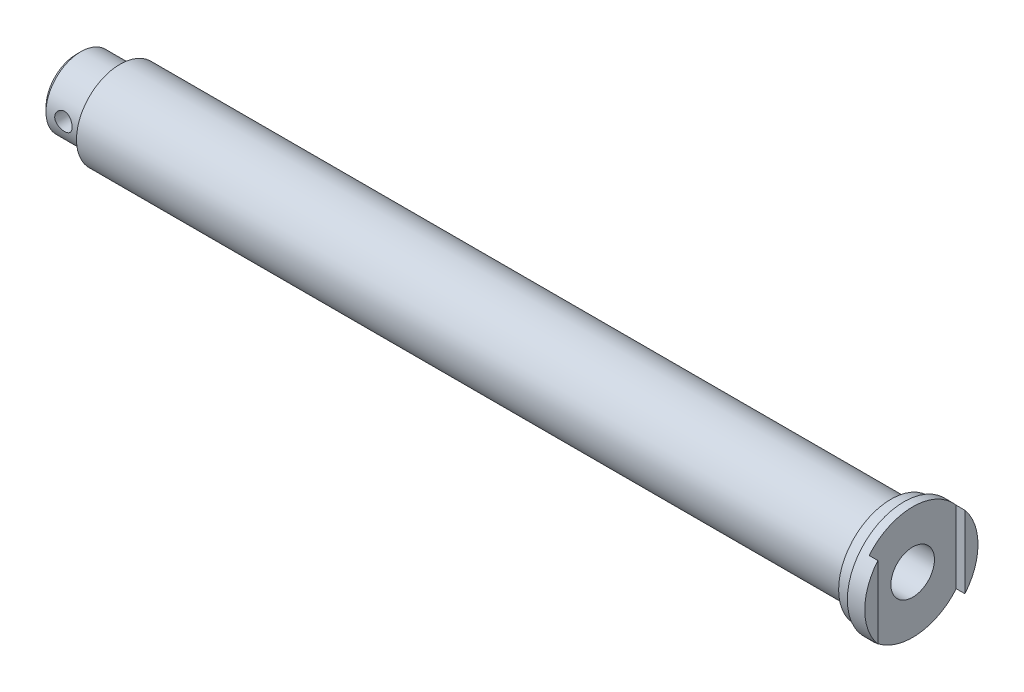
ISO-10303-21;
HEADER;
FILE_DESCRIPTION(('STEP AP214'),'2;1');
FILE_NAME('part.step','',(''),(''),'','','');
FILE_SCHEMA(('AUTOMOTIVE_DESIGN { 1 0 10303 214 1 1 1 1 }'));
ENDSEC;
DATA;
#1=APPLICATION_CONTEXT('core data for automotive mechanical design processes');
#2=APPLICATION_PROTOCOL_DEFINITION('international standard','automotive_design',2000,#1);
#3=PRODUCT_CONTEXT('',#1,'mechanical');
#4=PRODUCT('Part','Part','',(#3));
#5=PRODUCT_RELATED_PRODUCT_CATEGORY('part','',(#4));
#6=PRODUCT_DEFINITION_FORMATION('','',#4);
#7=PRODUCT_DEFINITION_CONTEXT('part definition',#1,'design');
#8=PRODUCT_DEFINITION('design','',#6,#7);
#9=PRODUCT_DEFINITION_SHAPE('','',#8);
#10=(LENGTH_UNIT() NAMED_UNIT(*) SI_UNIT(.MILLI.,.METRE.));
#11=(NAMED_UNIT(*) PLANE_ANGLE_UNIT() SI_UNIT($,.RADIAN.));
#12=(NAMED_UNIT(*) SI_UNIT($,.STERADIAN.) SOLID_ANGLE_UNIT());
#13=UNCERTAINTY_MEASURE_WITH_UNIT(LENGTH_MEASURE(1.E-05),#10,'distance_accuracy_value','');
#14=(GEOMETRIC_REPRESENTATION_CONTEXT(3) GLOBAL_UNCERTAINTY_ASSIGNED_CONTEXT((#13)) GLOBAL_UNIT_ASSIGNED_CONTEXT((#10,
#11,#12)) REPRESENTATION_CONTEXT('',''));
#15=CARTESIAN_POINT('',(0.,0.,0.));
#16=DIRECTION('',(0.,0.,1.));
#17=DIRECTION('',(1.,0.,0.));
#18=AXIS2_PLACEMENT_3D('',#15,#16,#17);
#19=CARTESIAN_POINT('',(0.,0.,0.));
#20=DIRECTION('',(-1.,0.,0.));
#21=DIRECTION('',(0.,0.,1.));
#22=AXIS2_PLACEMENT_3D('',#19,#20,#21);
#23=PLANE('',#22);
#24=CARTESIAN_POINT('',(0.,0.,0.));
#25=DIRECTION('',(-1.,0.,0.));
#26=DIRECTION('',(0.,0.,1.));
#27=AXIS2_PLACEMENT_3D('',#24,#25,#26);
#28=CIRCLE('',#27,6.5);
#29=CARTESIAN_POINT('',(0.,4.15331193145903,-5.));
#30=VERTEX_POINT('',#29);
#31=CARTESIAN_POINT('',(0.,-4.15331193145904,-5.));
#32=VERTEX_POINT('',#31);
#33=EDGE_CURVE('E110',#30,#32,#28,.T.);
#34=ORIENTED_EDGE('',*,*,#33,.F.);
#35=DIRECTION('',(0.,-1.,0.));
#36=VECTOR('',#35,1.);
#37=CARTESIAN_POINT('',(0.,0.,-5.));
#38=LINE('',#37,#36);
#39=EDGE_CURVE('E131',#30,#32,#38,.T.);
#40=ORIENTED_EDGE('',*,*,#39,.T.);
#41=EDGE_LOOP('',(#34,#40));
#42=FACE_BOUND('',#41,.T.);
#43=ADVANCED_FACE('F34',(#42),#23,.F.);
#44=CARTESIAN_POINT('',(-97.,0.,0.));
#45=DIRECTION('',(1.,0.,0.));
#46=DIRECTION('',(0.,0.,-1.));
#47=AXIS2_PLACEMENT_3D('',#44,#45,#46);
#48=PLANE('',#47);
#49=CARTESIAN_POINT('',(-97.,0.,0.));
#50=DIRECTION('',(1.,0.,0.));
#51=DIRECTION('',(0.,0.,-1.));
#52=AXIS2_PLACEMENT_3D('',#49,#50,#51);
#53=CIRCLE('',#52,3.5);
#54=CARTESIAN_POINT('',(-97.,0.,-3.5));
#55=VERTEX_POINT('',#54);
#56=EDGE_CURVE('E42',#55,#55,#53,.F.);
#57=ORIENTED_EDGE('',*,*,#56,.T.);
#58=EDGE_LOOP('',(#57));
#59=FACE_BOUND('',#58,.T.);
#60=ADVANCED_FACE('F198',(#59),#48,.F.);
#61=CARTESIAN_POINT('',(0.,0.,0.));
#62=DIRECTION('',(-1.,0.,0.));
#63=DIRECTION('',(0.,0.,1.));
#64=AXIS2_PLACEMENT_3D('',#61,#62,#63);
#65=CYLINDRICAL_SURFACE('',#64,4.);
#66=CARTESIAN_POINT('',(-96.5,0.,0.));
#67=DIRECTION('',(1.,0.,0.));
#68=DIRECTION('',(0.,0.,-1.));
#69=AXIS2_PLACEMENT_3D('',#66,#67,#68);
#70=CIRCLE('',#69,4.);
#71=CARTESIAN_POINT('',(-96.5,0.,-4.));
#72=VERTEX_POINT('',#71);
#73=EDGE_CURVE('E11',#72,#72,#70,.T.);
#74=ORIENTED_EDGE('',*,*,#73,.T.);
#75=EDGE_LOOP('',(#74));
#76=FACE_BOUND('',#75,.T.);
#77=CARTESIAN_POINT('',(-93.5,0.,4.));
#78=CARTESIAN_POINT('',(-93.5000015504921,-0.0552507257798213,3.99999906578675));
#79=CARTESIAN_POINT('',(-93.5045943671825,-0.110518771887177,3.99884385421219));
#80=CARTESIAN_POINT('',(-93.522816767538,-0.219470882513689,3.99434742553261));
#81=CARTESIAN_POINT('',(-93.5364514730252,-0.273154031247159,3.99100496946646));
#82=CARTESIAN_POINT('',(-93.5722928356414,-0.377347248121718,3.98250417554693));
#83=CARTESIAN_POINT('',(-93.5944891991435,-0.427861042286671,3.97734801894725));
#84=CARTESIAN_POINT('',(-93.6467875933632,-0.524448087936287,3.96576895871729));
#85=CARTESIAN_POINT('',(-93.676889890746,-0.570521189565841,3.95934601236034));
#86=CARTESIAN_POINT('',(-93.7448005264361,-0.657867951533947,3.94578275727868));
#87=CARTESIAN_POINT('',(-93.7827410499728,-0.69903712670738,3.93863138099022));
#88=CARTESIAN_POINT('',(-93.8649681366059,-0.774499284802202,3.92449080078353));
#89=CARTESIAN_POINT('',(-93.9092554152977,-0.808791491299422,3.91750161525566));
#90=CARTESIAN_POINT('',(-94.0037301511583,-0.870017695199357,3.9043651713314));
#91=CARTESIAN_POINT('',(-94.0539954872069,-0.896834810616908,3.89823196313737));
#92=CARTESIAN_POINT('',(-94.1584989411056,-0.941597939033691,3.88766329874815));
#93=CARTESIAN_POINT('',(-94.2127364222172,-0.959545370292895,3.88322757115192));
#94=CARTESIAN_POINT('',(-94.3224956654683,-0.985703224536202,3.87666984478367));
#95=CARTESIAN_POINT('',(-94.3779699306999,-0.994101512222236,3.87450327383617));
#96=CARTESIAN_POINT('',(-94.4895790460093,-1.00150785004524,3.8725957502516));
#97=CARTESIAN_POINT('',(-94.5457137871324,-1.00051742787866,3.87285440299096));
#98=CARTESIAN_POINT('',(-94.6556105384963,-0.989324349759533,3.87572803664412));
#99=CARTESIAN_POINT('',(-94.7093970809767,-0.979345560127028,3.87828575334586));
#100=CARTESIAN_POINT('',(-94.8145073672742,-0.950816124602089,3.88537806450989));
#101=CARTESIAN_POINT('',(-94.8658309353526,-0.932264868046299,3.88991279980464));
#102=CARTESIAN_POINT('',(-94.9651586775013,-0.88692631862479,3.90050075936124));
#103=CARTESIAN_POINT('',(-95.0131241145263,-0.860057778155299,3.90656884979614));
#104=CARTESIAN_POINT('',(-95.1039458065045,-0.798904184009995,3.91953140564257));
#105=CARTESIAN_POINT('',(-95.1468011653782,-0.764617832539249,3.9264260155649));
#106=CARTESIAN_POINT('',(-95.2274690771296,-0.688442283120835,3.9405058702652));
#107=CARTESIAN_POINT('',(-95.2651029933742,-0.646364172110598,3.94769379651981));
#108=CARTESIAN_POINT('',(-95.3328141616426,-0.556407945002494,3.96137310385857));
#109=CARTESIAN_POINT('',(-95.3628911828424,-0.508529651805324,3.96786446366277));
#110=CARTESIAN_POINT('',(-95.4147003908163,-0.408077259120955,3.97945154729455));
#111=CARTESIAN_POINT('',(-95.4364035601696,-0.355487595472441,3.9845424008515));
#112=CARTESIAN_POINT('',(-95.4706115371397,-0.247250672095278,3.99271944660945));
#113=CARTESIAN_POINT('',(-95.4831181042788,-0.191603999433677,3.99580602226187));
#114=CARTESIAN_POINT('',(-95.4983050437059,-0.0803599802600387,3.9995699951425));
#115=CARTESIAN_POINT('',(-95.5012286840502,-0.0247978133254956,4.00030702338852));
#116=CARTESIAN_POINT('',(-95.4978339986297,0.0860219165343142,3.999458698763));
#117=CARTESIAN_POINT('',(-95.4915165048006,0.141279506429705,3.99787355494564));
#118=CARTESIAN_POINT('',(-95.4700193944058,0.2490761791843,3.99259720751572));
#119=CARTESIAN_POINT('',(-95.4549724910153,0.301643412645807,3.98893756123874));
#120=CARTESIAN_POINT('',(-95.4165952773144,0.403504861634978,3.97992471089423));
#121=CARTESIAN_POINT('',(-95.3932641304579,0.452798746021728,3.97457133579928));
#122=CARTESIAN_POINT('',(-95.3385092474169,0.547682089619874,3.96262205284207));
#123=CARTESIAN_POINT('',(-95.3069492584022,0.593190294557198,3.95600578244622));
#124=CARTESIAN_POINT('',(-95.2368067274687,0.678351075762143,3.94229672791613));
#125=CARTESIAN_POINT('',(-95.1982229735887,0.718002639315318,3.93520386167804));
#126=CARTESIAN_POINT('',(-95.1139986927704,0.791327045381799,3.92112637973848));
#127=CARTESIAN_POINT('',(-95.0682081979984,0.824829245081332,3.91414869458188));
#128=CARTESIAN_POINT('',(-94.9715115770229,0.883673839341777,3.90128585584826));
#129=CARTESIAN_POINT('',(-94.9206056780268,0.909016596105273,3.89540065378018));
#130=CARTESIAN_POINT('',(-94.815396185058,0.950634280406178,3.88545396489777));
#131=CARTESIAN_POINT('',(-94.7611149144373,0.966962931102692,3.88138170194604));
#132=CARTESIAN_POINT('',(-94.6504602414073,0.990230439969168,3.87551162726789));
#133=CARTESIAN_POINT('',(-94.5940872993117,0.997171351652423,3.87371331813291));
#134=CARTESIAN_POINT('',(-94.4825859840965,1.00135906022265,3.87263267469305));
#135=CARTESIAN_POINT('',(-94.4274683765835,0.998878598520066,3.87327955152176));
#136=CARTESIAN_POINT('',(-94.3184640742214,0.984918185541902,3.87685272671895));
#137=CARTESIAN_POINT('',(-94.2645773546576,0.973438415124506,3.87977897927905));
#138=CARTESIAN_POINT('',(-94.1598610272898,0.941954212961856,3.88754173788482));
#139=CARTESIAN_POINT('',(-94.1090151298399,0.922000936453573,3.89236676824207));
#140=CARTESIAN_POINT('',(-94.0113564115242,0.874176609070035,3.90338503816553));
#141=CARTESIAN_POINT('',(-93.9645441512087,0.846304460022783,3.90957846747182));
#142=CARTESIAN_POINT('',(-93.8749635806653,0.782578499091416,3.92283756175675));
#143=CARTESIAN_POINT('',(-93.8323326177174,0.746535441941495,3.92992176554505));
#144=CARTESIAN_POINT('',(-93.7536353034697,0.66785958079315,3.94405351497524));
#145=CARTESIAN_POINT('',(-93.717570513258,0.625225214174091,3.95110105151373));
#146=CARTESIAN_POINT('',(-93.6523924609569,0.533645057801726,3.96451770431775));
#147=CARTESIAN_POINT('',(-93.623416924219,0.484598948210929,3.97087222243912));
#148=CARTESIAN_POINT('',(-93.5741683580397,0.382177373006994,3.98203283316746));
#149=CARTESIAN_POINT('',(-93.553889092901,0.328805042291168,3.98684003466521));
#150=CARTESIAN_POINT('',(-93.5256187797802,0.229606835495654,3.99365373043694));
#151=CARTESIAN_POINT('',(-93.516032504631,0.184253447272052,3.9960172336846));
#152=CARTESIAN_POINT('',(-93.5032227042521,0.0926040476908594,3.99919070154632));
#153=CARTESIAN_POINT('',(-93.4999987004632,0.0463081074950795,4.00000078300596));
#154=CARTESIAN_POINT('',(-93.5,0.,4.));
#155=B_SPLINE_CURVE_WITH_KNOTS('',3,(#77,#78,#79,#80,#81,#82,#83,#84,#85,#86,#87,#88,#89,#90,
#91,#92,#93,#94,#95,#96,#97,#98,#99,#100,#101,#102,#103,#104,#105,#106,#107,#108,#109,#110,#111,
#112,#113,#114,#115,#116,#117,#118,#119,#120,#121,#122,#123,#124,#125,#126,#127,#128,#129,#130,
#131,#132,#133,#134,#135,#136,#137,#138,#139,#140,#141,#142,#143,#144,#145,#146,#147,#148,#149,
#150,#151,#152,#153,#154),.UNSPECIFIED.,.T.,.F.,(4,2,2,2,2,2,2,2,2,2,2,2,2,2,2,2,2,2,2,2,2,2,2,
2,2,2,2,2,2,2,2,2,2,2,2,2,2,2,4),(0.,0.16558247498126,0.331258825175928,0.496736601524072,
0.662219960112881,0.830762902914253,0.999324863867069,1.17039098363871,1.34142974112913,
1.50904196732955,1.67662692075131,1.84014998004676,2.00368468977357,2.16887018582585,
2.3340846055744,2.50401000646012,2.67394059705497,2.84445486006075,3.01493649125762,
3.18105539299517,3.34715934075161,3.51080183009357,3.67446084881526,3.84102391710234,
4.00761575338678,4.17829672802983,4.34897012499671,4.51861503076023,4.6882228216827,
4.85295853599073,5.01769093970688,5.18144267039631,5.34521712091267,5.51326384273273,
5.68135046513611,5.85248123666389,6.02348909214231,6.16228161961431,6.30106370695358),.UNSPECIFIED.);
#156=CARTESIAN_POINT('',(-93.5,0.,4.));
#157=VERTEX_POINT('',#156);
#158=EDGE_CURVE('E94',#157,#157,#155,.T.);
#159=ORIENTED_EDGE('',*,*,#158,.T.);
#160=EDGE_LOOP('',(#159));
#161=FACE_BOUND('',#160,.T.);
#162=CARTESIAN_POINT('',(-93.5,0.,-4.));
#163=CARTESIAN_POINT('',(-93.5000015504921,0.0552507257798096,-3.99999906578675));
#164=CARTESIAN_POINT('',(-93.5045943671825,0.110518771887165,-3.99884385421219));
#165=CARTESIAN_POINT('',(-93.522816767538,0.219470882513678,-3.99434742553261));
#166=CARTESIAN_POINT('',(-93.5364514730252,0.273154031247147,-3.99100496946646));
#167=CARTESIAN_POINT('',(-93.5722928356414,0.377347248121707,-3.98250417554693));
#168=CARTESIAN_POINT('',(-93.5944891991435,0.42786104228666,-3.97734801894725));
#169=CARTESIAN_POINT('',(-93.6467875933632,0.524448087936274,-3.96576895871729));
#170=CARTESIAN_POINT('',(-93.676889890746,0.570521189565826,-3.95934601236034));
#171=CARTESIAN_POINT('',(-93.7448005264362,0.657867951533932,-3.94578275727868));
#172=CARTESIAN_POINT('',(-93.7827410499728,0.699037126707368,-3.93863138099022));
#173=CARTESIAN_POINT('',(-93.8649681366059,0.774499284802191,-3.92449080078353));
#174=CARTESIAN_POINT('',(-93.9092554152977,0.808791491299412,-3.91750161525566));
#175=CARTESIAN_POINT('',(-94.0037301511583,0.870017695199346,-3.9043651713314));
#176=CARTESIAN_POINT('',(-94.0539954872069,0.896834810616896,-3.89823196313737));
#177=CARTESIAN_POINT('',(-94.1584989411056,0.941597939033675,-3.88766329874816));
#178=CARTESIAN_POINT('',(-94.2127364222172,0.959545370292877,-3.88322757115193));
#179=CARTESIAN_POINT('',(-94.3224956654683,0.98570322453618,-3.87666984478368));
#180=CARTESIAN_POINT('',(-94.3779699306999,0.994101512222213,-3.87450327383618));
#181=CARTESIAN_POINT('',(-94.4895790460093,1.00150785004522,-3.87259575025161));
#182=CARTESIAN_POINT('',(-94.5457137871324,1.00051742787864,-3.87285440299096));
#183=CARTESIAN_POINT('',(-94.6556105384963,0.989324349759507,-3.87572803664412));
#184=CARTESIAN_POINT('',(-94.7093970809767,0.979345560127,-3.87828575334587));
#185=CARTESIAN_POINT('',(-94.8145073672742,0.950816124602056,-3.88537806450989));
#186=CARTESIAN_POINT('',(-94.8658309353526,0.932264868046266,-3.88991279980465));
#187=CARTESIAN_POINT('',(-94.9651586775014,0.886926318624754,-3.90050075936125));
#188=CARTESIAN_POINT('',(-95.0131241145264,0.860057778155262,-3.90656884979614));
#189=CARTESIAN_POINT('',(-95.1039458065046,0.79890418400996,-3.91953140564257));
#190=CARTESIAN_POINT('',(-95.1468011653782,0.764617832539215,-3.9264260155649));
#191=CARTESIAN_POINT('',(-95.2274690771296,0.688442283120799,-3.94050587026521));
#192=CARTESIAN_POINT('',(-95.2651029933742,0.646364172110561,-3.94769379651981));
#193=CARTESIAN_POINT('',(-95.3328141616426,0.556407945002454,-3.96137310385857));
#194=CARTESIAN_POINT('',(-95.3628911828424,0.508529651805281,-3.96786446366277));
#195=CARTESIAN_POINT('',(-95.4147003908163,0.408077259120908,-3.97945154729455));
#196=CARTESIAN_POINT('',(-95.4364035601696,0.355487595472392,-3.9845424008515));
#197=CARTESIAN_POINT('',(-95.4706115371397,0.24725067209523,-3.99271944660946));
#198=CARTESIAN_POINT('',(-95.4831181042788,0.191603999433634,-3.99580602226187));
#199=CARTESIAN_POINT('',(-95.4983050437059,0.0803599802599993,-3.9995699951425));
#200=CARTESIAN_POINT('',(-95.5012286840502,0.024797813325455,-4.00030702338852));
#201=CARTESIAN_POINT('',(-95.4978339986297,-0.0860219165343546,-3.999458698763));
#202=CARTESIAN_POINT('',(-95.4915165048006,-0.141279506429744,-3.99787355494564));
#203=CARTESIAN_POINT('',(-95.4700193944057,-0.249076179184343,-3.99259720751571));
#204=CARTESIAN_POINT('',(-95.4549724910153,-0.301643412645854,-3.98893756123874));
#205=CARTESIAN_POINT('',(-95.4165952773144,-0.403504861635024,-3.97992471089422));
#206=CARTESIAN_POINT('',(-95.3932641304579,-0.45279874602177,-3.97457133579928));
#207=CARTESIAN_POINT('',(-95.3385092474168,-0.547682089619911,-3.96262205284207));
#208=CARTESIAN_POINT('',(-95.3069492584021,-0.593190294557236,-3.95600578244621));
#209=CARTESIAN_POINT('',(-95.2368067274687,-0.678351075762181,-3.94229672791613));
#210=CARTESIAN_POINT('',(-95.1982229735887,-0.718002639315353,-3.93520386167803));
#211=CARTESIAN_POINT('',(-95.1139986927704,-0.791327045381834,-3.92112637973847));
#212=CARTESIAN_POINT('',(-95.0682081979984,-0.82482924508137,-3.91414869458187));
#213=CARTESIAN_POINT('',(-94.9715115770229,-0.883673839341813,-3.90128585584825));
#214=CARTESIAN_POINT('',(-94.9206056780268,-0.909016596105304,-3.89540065378017));
#215=CARTESIAN_POINT('',(-94.8153961850579,-0.950634280406206,-3.88545396489776));
#216=CARTESIAN_POINT('',(-94.7611149144373,-0.966962931102721,-3.88138170194603));
#217=CARTESIAN_POINT('',(-94.6504602414072,-0.990230439969196,-3.87551162726789));
#218=CARTESIAN_POINT('',(-94.5940872993117,-0.997171351652449,-3.8737133181329));
#219=CARTESIAN_POINT('',(-94.4825859840965,-1.00135906022267,-3.87263267469304));
#220=CARTESIAN_POINT('',(-94.4274683765835,-0.998878598520088,-3.87327955152175));
#221=CARTESIAN_POINT('',(-94.3184640742213,-0.98491818554192,-3.87685272671895));
#222=CARTESIAN_POINT('',(-94.2645773546576,-0.973438415124521,-3.87977897927904));
#223=CARTESIAN_POINT('',(-94.1598610272897,-0.941954212961872,-3.88754173788481));
#224=CARTESIAN_POINT('',(-94.1090151298398,-0.922000936453593,-3.89236676824206));
#225=CARTESIAN_POINT('',(-94.0113564115242,-0.874176609070056,-3.90338503816552));
#226=CARTESIAN_POINT('',(-93.9645441512087,-0.846304460022799,-3.90957846747182));
#227=CARTESIAN_POINT('',(-93.8749635806653,-0.782578499091428,-3.92283756175675));
#228=CARTESIAN_POINT('',(-93.8323326177174,-0.746535441941506,-3.92992176554505));
#229=CARTESIAN_POINT('',(-93.7536353034697,-0.667859580793158,-3.94405351497524));
#230=CARTESIAN_POINT('',(-93.717570513258,-0.625225214174097,-3.95110105151373));
#231=CARTESIAN_POINT('',(-93.6523924609569,-0.533645057801732,-3.96451770431775));
#232=CARTESIAN_POINT('',(-93.6234169242189,-0.484598948210937,-3.97087222243912));
#233=CARTESIAN_POINT('',(-93.5741683580396,-0.382177373007001,-3.98203283316745));
#234=CARTESIAN_POINT('',(-93.553889092901,-0.328805042291174,-3.98684003466521));
#235=CARTESIAN_POINT('',(-93.5256187797802,-0.229606835495659,-3.99365373043694));
#236=CARTESIAN_POINT('',(-93.5160325046311,-0.184253447272057,-3.9960172336846));
#237=CARTESIAN_POINT('',(-93.503222704252,-0.0926040476908672,-3.99919070154632));
#238=CARTESIAN_POINT('',(-93.4999987004631,-0.0463081074950894,-4.00000078300596));
#239=CARTESIAN_POINT('',(-93.5,0.,-4.));
#240=B_SPLINE_CURVE_WITH_KNOTS('',3,(#162,#163,#164,#165,#166,#167,#168,#169,#170,#171,#172,
#173,#174,#175,#176,#177,#178,#179,#180,#181,#182,#183,#184,#185,#186,#187,#188,#189,#190,#191,
#192,#193,#194,#195,#196,#197,#198,#199,#200,#201,#202,#203,#204,#205,#206,#207,#208,#209,#210,
#211,#212,#213,#214,#215,#216,#217,#218,#219,#220,#221,#222,#223,#224,#225,#226,#227,#228,#229,
#230,#231,#232,#233,#234,#235,#236,#237,#238,#239),.UNSPECIFIED.,.T.,.F.,(4,2,2,2,2,2,2,2,2,2,2,
2,2,2,2,2,2,2,2,2,2,2,2,2,2,2,2,2,2,2,2,2,2,2,2,2,2,2,4),(0.,0.165582474981262,
0.331258825175934,0.496736601524079,0.662219960112883,0.830762902914258,0.999324863867074,
1.17039098363873,1.34142974112913,1.50904196732954,1.67662692075131,1.84014998004678,
2.00368468977359,2.16887018582585,2.33408460557441,2.50401000646011,2.67394059705498,
2.84445486006076,3.01493649125762,3.18105539299517,3.34715934075161,3.51080183009358,
3.67446084881526,3.84102391710234,4.00761575338679,4.17829672802983,4.34897012499671,
4.51861503076024,4.68822282168271,4.85295853599074,5.01769093970689,5.1814426703963,
5.34521712091267,5.51326384273273,5.68135046513612,5.8524812366639,6.02348909214232,
6.16228161961431,6.30106370695358),.UNSPECIFIED.);
#241=CARTESIAN_POINT('',(-93.5,0.,-4.));
#242=VERTEX_POINT('',#241);
#243=EDGE_CURVE('E138',#242,#242,#240,.T.);
#244=ORIENTED_EDGE('',*,*,#243,.T.);
#245=EDGE_LOOP('',(#244));
#246=FACE_BOUND('',#245,.T.);
#247=CARTESIAN_POINT('',(-92.,0.,0.));
#248=DIRECTION('',(-1.,0.,0.));
#249=DIRECTION('',(0.,0.,1.));
#250=AXIS2_PLACEMENT_3D('',#247,#248,#249);
#251=CIRCLE('',#250,4.);
#252=CARTESIAN_POINT('',(-92.,0.,4.));
#253=VERTEX_POINT('',#252);
#254=EDGE_CURVE('E126',#253,#253,#251,.T.);
#255=ORIENTED_EDGE('',*,*,#254,.T.);
#256=EDGE_LOOP('',(#255));
#257=FACE_BOUND('',#256,.T.);
#258=ADVANCED_FACE('F149',(#76,#161,#246,#257),#65,.T.);
#259=CARTESIAN_POINT('',(-92.,5.,0.));
#260=DIRECTION('',(1.,0.,0.));
#261=DIRECTION('',(0.,0.,-1.));
#262=AXIS2_PLACEMENT_3D('',#259,#260,#261);
#263=PLANE('',#262);
#264=ORIENTED_EDGE('',*,*,#254,.F.);
#265=EDGE_LOOP('',(#264));
#266=FACE_BOUND('',#265,.T.);
#267=CARTESIAN_POINT('',(-92.,0.,0.));
#268=DIRECTION('',(-1.,0.,0.));
#269=DIRECTION('',(0.,0.,1.));
#270=AXIS2_PLACEMENT_3D('',#267,#268,#269);
#271=CIRCLE('',#270,5.);
#272=CARTESIAN_POINT('',(-92.,0.,5.));
#273=VERTEX_POINT('',#272);
#274=EDGE_CURVE('E123',#273,#273,#271,.T.);
#275=ORIENTED_EDGE('',*,*,#274,.T.);
#276=EDGE_LOOP('',(#275));
#277=FACE_BOUND('',#276,.T.);
#278=ADVANCED_FACE('F191',(#266,#277),#263,.F.);
#279=CARTESIAN_POINT('',(0.,0.,0.));
#280=DIRECTION('',(-1.,0.,0.));
#281=DIRECTION('',(0.,0.,1.));
#282=AXIS2_PLACEMENT_3D('',#279,#280,#281);
#283=CYLINDRICAL_SURFACE('',#282,5.);
#284=ORIENTED_EDGE('',*,*,#274,.F.);
#285=EDGE_LOOP('',(#284));
#286=FACE_BOUND('',#285,.T.);
#287=CARTESIAN_POINT('',(-3.5,0.,0.));
#288=DIRECTION('',(-1.,0.,0.));
#289=DIRECTION('',(0.,0.,1.));
#290=AXIS2_PLACEMENT_3D('',#287,#288,#289);
#291=CIRCLE('',#290,5.);
#292=CARTESIAN_POINT('',(-3.5,0.,5.));
#293=VERTEX_POINT('',#292);
#294=EDGE_CURVE('E120',#293,#293,#291,.T.);
#295=ORIENTED_EDGE('',*,*,#294,.T.);
#296=EDGE_LOOP('',(#295));
#297=FACE_BOUND('',#296,.T.);
#298=ADVANCED_FACE('F188',(#286,#297),#283,.T.);
#299=CARTESIAN_POINT('',(-3.5,5.,0.));
#300=DIRECTION('',(1.,0.,0.));
#301=DIRECTION('',(0.,0.,-1.));
#302=AXIS2_PLACEMENT_3D('',#299,#300,#301);
#303=PLANE('',#302);
#304=ORIENTED_EDGE('',*,*,#294,.F.);
#305=EDGE_LOOP('',(#304));
#306=FACE_BOUND('',#305,.T.);
#307=CARTESIAN_POINT('',(-3.5,0.,0.));
#308=DIRECTION('',(-1.,0.,0.));
#309=DIRECTION('',(0.,0.,1.));
#310=AXIS2_PLACEMENT_3D('',#307,#308,#309);
#311=CIRCLE('',#310,6.);
#312=CARTESIAN_POINT('',(-3.5,0.,6.));
#313=VERTEX_POINT('',#312);
#314=EDGE_CURVE('E117',#313,#313,#311,.T.);
#315=ORIENTED_EDGE('',*,*,#314,.T.);
#316=EDGE_LOOP('',(#315));
#317=FACE_BOUND('',#316,.T.);
#318=ADVANCED_FACE('F184',(#306,#317),#303,.F.);
#319=CARTESIAN_POINT('',(0.,0.,0.));
#320=DIRECTION('',(-1.,0.,0.));
#321=DIRECTION('',(0.,0.,1.));
#322=AXIS2_PLACEMENT_3D('',#319,#320,#321);
#323=CYLINDRICAL_SURFACE('',#322,6.);
#324=ORIENTED_EDGE('',*,*,#314,.F.);
#325=EDGE_LOOP('',(#324));
#326=FACE_BOUND('',#325,.T.);
#327=CARTESIAN_POINT('',(-2.,0.,0.));
#328=DIRECTION('',(-1.,0.,0.));
#329=DIRECTION('',(0.,0.,1.));
#330=AXIS2_PLACEMENT_3D('',#327,#328,#329);
#331=CIRCLE('',#330,6.);
#332=CARTESIAN_POINT('',(-2.,0.,6.));
#333=VERTEX_POINT('',#332);
#334=EDGE_CURVE('E114',#333,#333,#331,.T.);
#335=ORIENTED_EDGE('',*,*,#334,.T.);
#336=EDGE_LOOP('',(#335));
#337=FACE_BOUND('',#336,.T.);
#338=ADVANCED_FACE('F180',(#326,#337),#323,.T.);
#339=CARTESIAN_POINT('',(-2.,6.,0.));
#340=DIRECTION('',(1.,0.,0.));
#341=DIRECTION('',(0.,0.,-1.));
#342=AXIS2_PLACEMENT_3D('',#339,#340,#341);
#343=PLANE('',#342);
#344=ORIENTED_EDGE('',*,*,#334,.F.);
#345=EDGE_LOOP('',(#344));
#346=FACE_BOUND('',#345,.T.);
#347=CARTESIAN_POINT('',(-2.,0.,0.));
#348=DIRECTION('',(-1.,0.,0.));
#349=DIRECTION('',(0.,0.,1.));
#350=AXIS2_PLACEMENT_3D('',#347,#348,#349);
#351=CIRCLE('',#350,6.5);
#352=CARTESIAN_POINT('',(-2.,0.,6.5));
#353=VERTEX_POINT('',#352);
#354=EDGE_CURVE('E111',#353,#353,#351,.T.);
#355=ORIENTED_EDGE('',*,*,#354,.T.);
#356=EDGE_LOOP('',(#355));
#357=FACE_BOUND('',#356,.T.);
#358=ADVANCED_FACE('F176',(#346,#357),#343,.F.);
#359=CARTESIAN_POINT('',(0.,0.,0.));
#360=DIRECTION('',(-1.,0.,0.));
#361=DIRECTION('',(0.,0.,1.));
#362=AXIS2_PLACEMENT_3D('',#359,#360,#361);
#363=CYLINDRICAL_SURFACE('',#362,6.5);
#364=CARTESIAN_POINT('',(-1.,0.,0.));
#365=DIRECTION('',(-1.,0.,0.));
#366=DIRECTION('',(0.,0.,1.));
#367=AXIS2_PLACEMENT_3D('',#364,#365,#366);
#368=CIRCLE('',#367,6.5);
#369=CARTESIAN_POINT('',(-1.,4.15331193145904,5.));
#370=VERTEX_POINT('',#369);
#371=CARTESIAN_POINT('',(-1.,4.15331193145904,-5.));
#372=VERTEX_POINT('',#371);
#373=EDGE_CURVE('E137',#370,#372,#368,.T.);
#374=ORIENTED_EDGE('',*,*,#373,.T.);
#375=DIRECTION('',(-1.,0.,0.));
#376=VECTOR('',#375,1.);
#377=CARTESIAN_POINT('',(0.,4.15331193145904,-5.));
#378=LINE('',#377,#376);
#379=EDGE_CURVE('E57',#372,#30,#378,.F.);
#380=ORIENTED_EDGE('',*,*,#379,.T.);
#381=ORIENTED_EDGE('',*,*,#33,.T.);
#382=DIRECTION('',(-1.,0.,0.));
#383=VECTOR('',#382,1.);
#384=CARTESIAN_POINT('',(0.,-4.15331193145904,-5.));
#385=LINE('',#384,#383);
#386=CARTESIAN_POINT('',(-1.,-4.15331193145904,-5.));
#387=VERTEX_POINT('',#386);
#388=EDGE_CURVE('E104',#32,#387,#385,.T.);
#389=ORIENTED_EDGE('',*,*,#388,.T.);
#390=CARTESIAN_POINT('',(-1.,-4.15331193145904,5.));
#391=VERTEX_POINT('',#390);
#392=EDGE_CURVE('E134',#387,#391,#368,.T.);
#393=ORIENTED_EDGE('',*,*,#392,.T.);
#394=DIRECTION('',(-1.,0.,0.));
#395=VECTOR('',#394,1.);
#396=CARTESIAN_POINT('',(0.,-4.15331193145904,5.));
#397=LINE('',#396,#395);
#398=CARTESIAN_POINT('',(0.,-4.15331193145904,5.));
#399=VERTEX_POINT('',#398);
#400=EDGE_CURVE('E99',#391,#399,#397,.F.);
#401=ORIENTED_EDGE('',*,*,#400,.T.);
#402=CARTESIAN_POINT('',(0.,4.15331193145904,5.));
#403=VERTEX_POINT('',#402);
#404=EDGE_CURVE('E107',#399,#403,#28,.T.);
#405=ORIENTED_EDGE('',*,*,#404,.T.);
#406=DIRECTION('',(-1.,0.,0.));
#407=VECTOR('',#406,1.);
#408=CARTESIAN_POINT('',(0.,4.15331193145904,5.));
#409=LINE('',#408,#407);
#410=EDGE_CURVE('E49',#403,#370,#409,.T.);
#411=ORIENTED_EDGE('',*,*,#410,.T.);
#412=EDGE_LOOP('',(#374,#380,#381,#389,#393,#401,#405,#411));
#413=FACE_BOUND('',#412,.T.);
#414=ORIENTED_EDGE('',*,*,#354,.F.);
#415=EDGE_LOOP('',(#414));
#416=FACE_BOUND('',#415,.T.);
#417=ADVANCED_FACE('F172',(#413,#416),#363,.T.);
#418=ORIENTED_EDGE('',*,*,#404,.F.);
#419=DIRECTION('',(0.,1.,0.));
#420=VECTOR('',#419,1.);
#421=CARTESIAN_POINT('',(0.,0.,5.));
#422=LINE('',#421,#420);
#423=EDGE_CURVE('E129',#399,#403,#422,.T.);
#424=ORIENTED_EDGE('',*,*,#423,.T.);
#425=EDGE_LOOP('',(#418,#424));
#426=FACE_BOUND('',#425,.T.);
#427=ADVANCED_FACE('F164',(#426),#23,.F.);
#428=CARTESIAN_POINT('',(-1.,0.,0.));
#429=DIRECTION('',(-1.,0.,0.));
#430=DIRECTION('',(0.,0.,1.));
#431=AXIS2_PLACEMENT_3D('',#428,#429,#430);
#432=PLANE('',#431);
#433=CARTESIAN_POINT('',(-0.999999999999999,0.,0.));
#434=DIRECTION('',(1.,0.,0.));
#435=DIRECTION('',(0.,0.,-1.));
#436=AXIS2_PLACEMENT_3D('',#433,#434,#435);
#437=CIRCLE('',#436,2.49999999999999);
#438=CARTESIAN_POINT('',(-0.999999999999999,0.,-2.49999999999999));
#439=VERTEX_POINT('',#438);
#440=EDGE_CURVE('E89',#439,#439,#437,.T.);
#441=ORIENTED_EDGE('',*,*,#440,.F.);
#442=EDGE_LOOP('',(#441));
#443=FACE_BOUND('',#442,.T.);
#444=DIRECTION('',(0.,-1.,0.));
#445=VECTOR('',#444,1.);
#446=CARTESIAN_POINT('',(-1.,-6.5,5.));
#447=LINE('',#446,#445);
#448=EDGE_CURVE('E91',#370,#391,#447,.T.);
#449=ORIENTED_EDGE('',*,*,#448,.T.);
#450=ORIENTED_EDGE('',*,*,#392,.F.);
#451=DIRECTION('',(0.,1.,0.));
#452=VECTOR('',#451,1.);
#453=CARTESIAN_POINT('',(-1.,-6.5,-5.));
#454=LINE('',#453,#452);
#455=EDGE_CURVE('E88',#387,#372,#454,.T.);
#456=ORIENTED_EDGE('',*,*,#455,.T.);
#457=ORIENTED_EDGE('',*,*,#373,.F.);
#458=EDGE_LOOP('',(#449,#450,#456,#457));
#459=FACE_BOUND('',#458,.T.);
#460=ADVANCED_FACE('F160',(#443,#459),#432,.F.);
#461=CARTESIAN_POINT('',(-1.,-6.5,-5.));
#462=DIRECTION('',(0.,0.,-1.));
#463=DIRECTION('',(-1.,0.,0.));
#464=AXIS2_PLACEMENT_3D('',#461,#462,#463);
#465=PLANE('',#464);
#466=ORIENTED_EDGE('',*,*,#39,.F.);
#467=ORIENTED_EDGE('',*,*,#379,.F.);
#468=ORIENTED_EDGE('',*,*,#455,.F.);
#469=ORIENTED_EDGE('',*,*,#388,.F.);
#470=EDGE_LOOP('',(#466,#467,#468,#469));
#471=FACE_BOUND('',#470,.T.);
#472=ADVANCED_FACE('F163',(#471),#465,.F.);
#473=CARTESIAN_POINT('',(-1.,-6.5,5.));
#474=DIRECTION('',(0.,0.,1.));
#475=DIRECTION('',(1.,0.,0.));
#476=AXIS2_PLACEMENT_3D('',#473,#474,#475);
#477=PLANE('',#476);
#478=ORIENTED_EDGE('',*,*,#423,.F.);
#479=ORIENTED_EDGE('',*,*,#400,.F.);
#480=ORIENTED_EDGE('',*,*,#448,.F.);
#481=ORIENTED_EDGE('',*,*,#410,.F.);
#482=EDGE_LOOP('',(#478,#479,#480,#481));
#483=FACE_BOUND('',#482,.T.);
#484=ADVANCED_FACE('F82',(#483),#477,.F.);
#485=CARTESIAN_POINT('',(-11.,0.,0.));
#486=DIRECTION('',(1.,0.,0.));
#487=DIRECTION('',(0.,0.,-1.));
#488=AXIS2_PLACEMENT_3D('',#485,#486,#487);
#489=CONICAL_SURFACE('',#488,2.5,1.02974425867665);
#490=CARTESIAN_POINT('',(-12.5021515475689,0.,0.));
#491=VERTEX_POINT('',#490);
#492=VERTEX_LOOP('',#491);
#493=FACE_BOUND('',#492,.T.);
#494=CARTESIAN_POINT('',(-11.,0.,0.));
#495=DIRECTION('',(1.,0.,0.));
#496=DIRECTION('',(0.,0.,-1.));
#497=AXIS2_PLACEMENT_3D('',#494,#495,#496);
#498=CIRCLE('',#497,2.5);
#499=CARTESIAN_POINT('',(-11.,0.,-2.5));
#500=VERTEX_POINT('',#499);
#501=EDGE_CURVE('E86',#500,#500,#498,.T.);
#502=ORIENTED_EDGE('',*,*,#501,.T.);
#503=EDGE_LOOP('',(#502));
#504=FACE_BOUND('',#503,.T.);
#505=ADVANCED_FACE('F78',(#493,#504),#489,.F.);
#506=CARTESIAN_POINT('',(-1.,0.,0.));
#507=DIRECTION('',(1.,0.,0.));
#508=DIRECTION('',(0.,0.,-1.));
#509=AXIS2_PLACEMENT_3D('',#506,#507,#508);
#510=CYLINDRICAL_SURFACE('',#509,2.49999999999999);
#511=ORIENTED_EDGE('',*,*,#501,.F.);
#512=EDGE_LOOP('',(#511));
#513=FACE_BOUND('',#512,.T.);
#514=ORIENTED_EDGE('',*,*,#440,.T.);
#515=EDGE_LOOP('',(#514));
#516=FACE_BOUND('',#515,.T.);
#517=ADVANCED_FACE('F81',(#513,#516),#510,.F.);
#518=CARTESIAN_POINT('',(-94.5,0.,-6.5));
#519=DIRECTION('',(0.,0.,1.));
#520=DIRECTION('',(1.,0.,0.));
#521=AXIS2_PLACEMENT_3D('',#518,#519,#520);
#522=CYLINDRICAL_SURFACE('',#521,0.999999999999998);
#523=ORIENTED_EDGE('',*,*,#243,.F.);
#524=EDGE_LOOP('',(#523));
#525=FACE_BOUND('',#524,.T.);
#526=ORIENTED_EDGE('',*,*,#158,.F.);
#527=EDGE_LOOP('',(#526));
#528=FACE_BOUND('',#527,.T.);
#529=ADVANCED_FACE('F152',(#525,#528),#522,.F.);
#530=CARTESIAN_POINT('',(-97.,0.,0.));
#531=DIRECTION('',(1.,0.,0.));
#532=DIRECTION('',(0.,0.,-1.));
#533=AXIS2_PLACEMENT_3D('',#530,#531,#532);
#534=CONICAL_SURFACE('',#533,3.5,0.785398163397431);
#535=ORIENTED_EDGE('',*,*,#73,.F.);
#536=EDGE_LOOP('',(#535));
#537=FACE_BOUND('',#536,.T.);
#538=ORIENTED_EDGE('',*,*,#56,.F.);
#539=EDGE_LOOP('',(#538));
#540=FACE_BOUND('',#539,.T.);
#541=ADVANCED_FACE('F36',(#537,#540),#534,.T.);
#542=CLOSED_SHELL('',(#43,#60,#258,#278,#298,#318,#338,#358,#417,#427,#460,#472,#484,#505,#517,
#529,#541));
#543=MANIFOLD_SOLID_BREP('B2',#542);
#544=ADVANCED_BREP_SHAPE_REPRESENTATION('',(#18,#543),#14);
#545=SHAPE_DEFINITION_REPRESENTATION(#9,#544);
ENDSEC;
END-ISO-10303-21;
